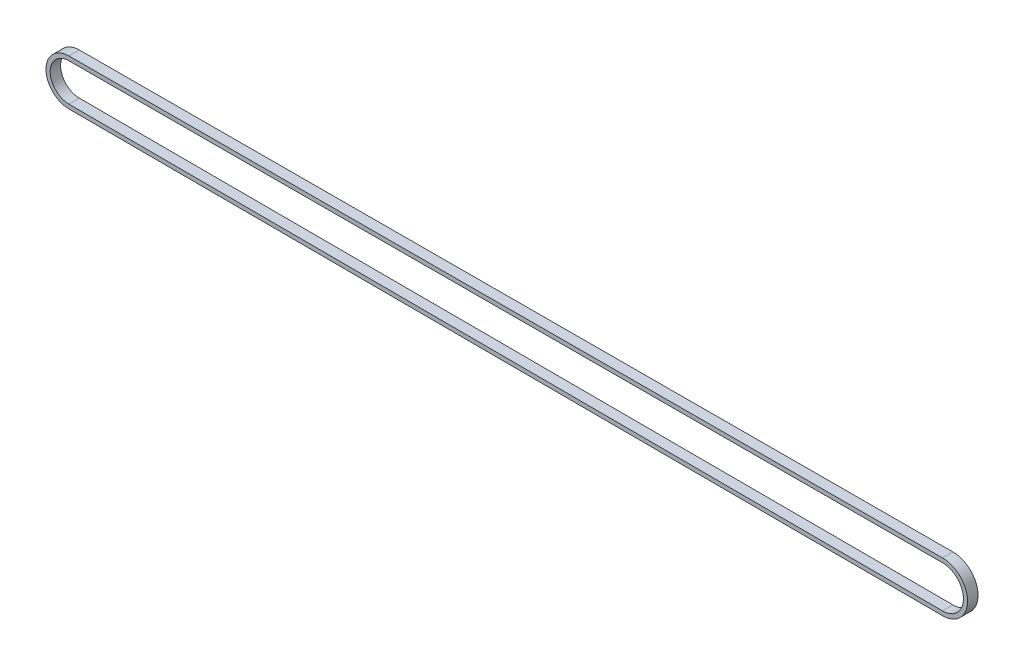
ISO-10303-21;
HEADER;
FILE_DESCRIPTION(('STEP AP214'),'2;1');
FILE_NAME('part.step','',(''),(''),'','','');
FILE_SCHEMA(('AUTOMOTIVE_DESIGN { 1 0 10303 214 1 1 1 1 }'));
ENDSEC;
DATA;
#1=APPLICATION_CONTEXT('core data for automotive mechanical design processes');
#2=APPLICATION_PROTOCOL_DEFINITION('international standard','automotive_design',2000,#1);
#3=PRODUCT_CONTEXT('',#1,'mechanical');
#4=PRODUCT('Part','Part','',(#3));
#5=PRODUCT_RELATED_PRODUCT_CATEGORY('part','',(#4));
#6=PRODUCT_DEFINITION_FORMATION('','',#4);
#7=PRODUCT_DEFINITION_CONTEXT('part definition',#1,'design');
#8=PRODUCT_DEFINITION('design','',#6,#7);
#9=PRODUCT_DEFINITION_SHAPE('','',#8);
#10=(LENGTH_UNIT() NAMED_UNIT(*) SI_UNIT(.MILLI.,.METRE.));
#11=(NAMED_UNIT(*) PLANE_ANGLE_UNIT() SI_UNIT($,.RADIAN.));
#12=(NAMED_UNIT(*) SI_UNIT($,.STERADIAN.) SOLID_ANGLE_UNIT());
#13=UNCERTAINTY_MEASURE_WITH_UNIT(LENGTH_MEASURE(1.E-05),#10,'distance_accuracy_value','');
#14=(GEOMETRIC_REPRESENTATION_CONTEXT(3) GLOBAL_UNCERTAINTY_ASSIGNED_CONTEXT((#13)) GLOBAL_UNIT_ASSIGNED_CONTEXT((#10,
#11,#12)) REPRESENTATION_CONTEXT('',''));
#15=CARTESIAN_POINT('',(0.,0.,0.));
#16=DIRECTION('',(0.,0.,1.));
#17=DIRECTION('',(1.,0.,0.));
#18=AXIS2_PLACEMENT_3D('',#15,#16,#17);
#19=CARTESIAN_POINT('',(0.,0.,-5.));
#20=DIRECTION('',(0.,0.,1.));
#21=DIRECTION('',(1.,0.,0.));
#22=AXIS2_PLACEMENT_3D('',#19,#20,#21);
#23=CYLINDRICAL_SURFACE('',#22,12.);
#24=CARTESIAN_POINT('',(0.,0.,0.));
#25=DIRECTION('',(0.,0.,-1.));
#26=DIRECTION('',(-1.,0.,0.));
#27=AXIS2_PLACEMENT_3D('',#24,#25,#26);
#28=CIRCLE('',#27,12.);
#29=CARTESIAN_POINT('',(-0.0286396181383211,-11.999965823796,0.));
#30=VERTEX_POINT('',#29);
#31=CARTESIAN_POINT('',(-0.0286396181384263,11.999965823796,0.));
#32=VERTEX_POINT('',#31);
#33=EDGE_CURVE('E159',#30,#32,#28,.F.);
#34=ORIENTED_EDGE('',*,*,#33,.F.);
#35=DIRECTION('',(0.,0.,1.));
#36=VECTOR('',#35,1.);
#37=CARTESIAN_POINT('',(-0.0286396181383211,-11.999965823796,-5.));
#38=LINE('',#37,#36);
#39=CARTESIAN_POINT('',(-0.0286396181383211,-11.999965823796,-5.));
#40=VERTEX_POINT('',#39);
#41=EDGE_CURVE('E12',#40,#30,#38,.T.);
#42=ORIENTED_EDGE('',*,*,#41,.F.);
#43=CARTESIAN_POINT('',(0.,0.,-5.));
#44=DIRECTION('',(0.,0.,-1.));
#45=DIRECTION('',(-1.,0.,0.));
#46=AXIS2_PLACEMENT_3D('',#43,#44,#45);
#47=CIRCLE('',#46,12.);
#48=CARTESIAN_POINT('',(-0.0286396181384263,11.999965823796,-5.));
#49=VERTEX_POINT('',#48);
#50=EDGE_CURVE('E163',#40,#49,#47,.F.);
#51=ORIENTED_EDGE('',*,*,#50,.T.);
#52=DIRECTION('',(0.,0.,1.));
#53=VECTOR('',#52,1.);
#54=CARTESIAN_POINT('',(-0.0286396181384263,11.999965823796,-5.));
#55=LINE('',#54,#53);
#56=EDGE_CURVE('E64',#49,#32,#55,.T.);
#57=ORIENTED_EDGE('',*,*,#56,.T.);
#58=EDGE_LOOP('',(#34,#42,#51,#57));
#59=FACE_BOUND('',#58,.T.);
#60=ADVANCED_FACE('F61',(#59),#23,.T.);
#61=CARTESIAN_POINT('',(-0.0286396181383211,-11.999965823796,-5.));
#62=DIRECTION('',(-0.00238663484486009,-0.999997151983003,0.));
#63=DIRECTION('',(0.999997151983003,-0.00238663484486009,0.));
#64=AXIS2_PLACEMENT_3D('',#61,#62,#63);
#65=PLANE('',#64);
#66=DIRECTION('',(0.999997151983003,-0.00238663484486009,0.));
#67=VECTOR('',#66,1.);
#68=CARTESIAN_POINT('',(-0.0286396181383211,-11.999965823796,0.));
#69=LINE('',#68,#67);
#70=CARTESIAN_POINT('',(-419.026252983293,-10.9999686718167,0.));
#71=VERTEX_POINT('',#70);
#72=EDGE_CURVE('E167',#71,#30,#69,.T.);
#73=ORIENTED_EDGE('',*,*,#72,.F.);
#74=DIRECTION('',(0.,0.,1.));
#75=VECTOR('',#74,1.);
#76=CARTESIAN_POINT('',(-419.026252983293,-10.9999686718167,-5.));
#77=LINE('',#76,#75);
#78=CARTESIAN_POINT('',(-419.026252983293,-10.9999686718167,-5.));
#79=VERTEX_POINT('',#78);
#80=EDGE_CURVE('E69',#79,#71,#77,.T.);
#81=ORIENTED_EDGE('',*,*,#80,.F.);
#82=DIRECTION('',(0.999997151983003,-0.00238663484486009,0.));
#83=VECTOR('',#82,1.);
#84=CARTESIAN_POINT('',(-0.0286396181383211,-11.999965823796,-5.));
#85=LINE('',#84,#83);
#86=EDGE_CURVE('E173',#79,#40,#85,.T.);
#87=ORIENTED_EDGE('',*,*,#86,.T.);
#88=ORIENTED_EDGE('',*,*,#41,.T.);
#89=EDGE_LOOP('',(#73,#81,#87,#88));
#90=FACE_BOUND('',#89,.T.);
#91=ADVANCED_FACE('F199',(#90),#65,.T.);
#92=CARTESIAN_POINT('',(-418.999999999999,-3.62210261783957E-12,-5.));
#93=DIRECTION('',(0.,0.,1.));
#94=DIRECTION('',(1.,0.,0.));
#95=AXIS2_PLACEMENT_3D('',#92,#93,#94);
#96=CYLINDRICAL_SURFACE('',#95,11.);
#97=CARTESIAN_POINT('',(-418.999999999999,-3.62210261783957E-12,0.));
#98=DIRECTION('',(0.,0.,-1.));
#99=DIRECTION('',(-1.,0.,0.));
#100=AXIS2_PLACEMENT_3D('',#97,#98,#99);
#101=CIRCLE('',#100,11.);
#102=CARTESIAN_POINT('',(-419.026252983293,10.9999686718094,0.));
#103=VERTEX_POINT('',#102);
#104=EDGE_CURVE('E181',#103,#71,#101,.F.);
#105=ORIENTED_EDGE('',*,*,#104,.F.);
#106=DIRECTION('',(0.,0.,1.));
#107=VECTOR('',#106,1.);
#108=CARTESIAN_POINT('',(-419.026252983293,10.9999686718094,-5.));
#109=LINE('',#108,#107);
#110=CARTESIAN_POINT('',(-419.026252983293,10.9999686718094,-5.));
#111=VERTEX_POINT('',#110);
#112=EDGE_CURVE('E186',#111,#103,#109,.T.);
#113=ORIENTED_EDGE('',*,*,#112,.F.);
#114=CARTESIAN_POINT('',(-418.999999999999,-3.62210261783957E-12,-5.));
#115=DIRECTION('',(0.,0.,-1.));
#116=DIRECTION('',(-1.,0.,0.));
#117=AXIS2_PLACEMENT_3D('',#114,#115,#116);
#118=CIRCLE('',#117,11.);
#119=EDGE_CURVE('E170',#111,#79,#118,.F.);
#120=ORIENTED_EDGE('',*,*,#119,.T.);
#121=ORIENTED_EDGE('',*,*,#80,.T.);
#122=EDGE_LOOP('',(#105,#113,#120,#121));
#123=FACE_BOUND('',#122,.T.);
#124=ADVANCED_FACE('F203',(#123),#96,.T.);
#125=CARTESIAN_POINT('',(-0.0286396181385286,11.999965823796,-5.));
#126=DIRECTION('',(-0.00238663484487738,0.999997151983003,0.));
#127=DIRECTION('',(-0.999997151983003,-0.00238663484487738,0.));
#128=AXIS2_PLACEMENT_3D('',#125,#126,#127);
#129=PLANE('',#128);
#130=DIRECTION('',(-0.999997151983003,-0.00238663484487738,0.));
#131=VECTOR('',#130,1.);
#132=CARTESIAN_POINT('',(-0.0286396181385286,11.999965823796,0.));
#133=LINE('',#132,#131);
#134=EDGE_CURVE('E178',#32,#103,#133,.T.);
#135=ORIENTED_EDGE('',*,*,#134,.F.);
#136=ORIENTED_EDGE('',*,*,#56,.F.);
#137=DIRECTION('',(-0.999997151983003,-0.00238663484487738,0.));
#138=VECTOR('',#137,1.);
#139=CARTESIAN_POINT('',(-0.0286396181385286,11.999965823796,-5.));
#140=LINE('',#139,#138);
#141=EDGE_CURVE('E166',#49,#111,#140,.T.);
#142=ORIENTED_EDGE('',*,*,#141,.T.);
#143=ORIENTED_EDGE('',*,*,#112,.T.);
#144=EDGE_LOOP('',(#135,#136,#142,#143));
#145=FACE_BOUND('',#144,.T.);
#146=ADVANCED_FACE('F194',(#145),#129,.T.);
#147=CARTESIAN_POINT('',(0.,0.,-5.));
#148=DIRECTION('',(0.,0.,-1.));
#149=DIRECTION('',(-1.,0.,0.));
#150=AXIS2_PLACEMENT_3D('',#147,#148,#149);
#151=PLANE('',#150);
#152=CARTESIAN_POINT('',(0.,0.,-5.));
#153=DIRECTION('',(0.,0.,1.));
#154=DIRECTION('',(-1.,0.,0.));
#155=AXIS2_PLACEMENT_3D('',#152,#153,#154);
#156=CIRCLE('',#155,10.);
#157=CARTESIAN_POINT('',(-0.0238663484486009,-9.99997151983003,-5.));
#158=VERTEX_POINT('',#157);
#159=CARTESIAN_POINT('',(-0.0238663484487738,9.99997151983003,-5.));
#160=VERTEX_POINT('',#159);
#161=EDGE_CURVE('E128',#158,#160,#156,.T.);
#162=ORIENTED_EDGE('',*,*,#161,.T.);
#163=DIRECTION('',(-0.999997151983003,-0.00238663484487738,0.));
#164=VECTOR('',#163,1.);
#165=CARTESIAN_POINT('',(-419.021479713603,8.99997436784341,-5.));
#166=LINE('',#165,#164);
#167=CARTESIAN_POINT('',(-419.021479713603,8.99997436784341,-5.));
#168=VERTEX_POINT('',#167);
#169=EDGE_CURVE('E137',#160,#168,#166,.T.);
#170=ORIENTED_EDGE('',*,*,#169,.T.);
#171=CARTESIAN_POINT('',(-418.999999999999,-3.62210261783957E-12,-5.));
#172=DIRECTION('',(0.,0.,1.));
#173=DIRECTION('',(-1.,0.,0.));
#174=AXIS2_PLACEMENT_3D('',#171,#172,#173);
#175=CIRCLE('',#174,9.);
#176=CARTESIAN_POINT('',(-419.021479713603,-8.99997436785065,-5.));
#177=VERTEX_POINT('',#176);
#178=EDGE_CURVE('E77',#168,#177,#175,.T.);
#179=ORIENTED_EDGE('',*,*,#178,.T.);
#180=DIRECTION('',(0.999997151983003,-0.00238663484486009,0.));
#181=VECTOR('',#180,1.);
#182=CARTESIAN_POINT('',(-0.0238663484486009,-9.99997151983003,-5.));
#183=LINE('',#182,#181);
#184=EDGE_CURVE('E134',#177,#158,#183,.T.);
#185=ORIENTED_EDGE('',*,*,#184,.T.);
#186=EDGE_LOOP('',(#162,#170,#179,#185));
#187=FACE_BOUND('',#186,.T.);
#188=ORIENTED_EDGE('',*,*,#50,.F.);
#189=ORIENTED_EDGE('',*,*,#86,.F.);
#190=ORIENTED_EDGE('',*,*,#119,.F.);
#191=ORIENTED_EDGE('',*,*,#141,.F.);
#192=EDGE_LOOP('',(#188,#189,#190,#191));
#193=FACE_BOUND('',#192,.T.);
#194=ADVANCED_FACE('F141',(#187,#193),#151,.T.);
#195=CARTESIAN_POINT('',(0.,0.,0.));
#196=DIRECTION('',(0.,0.,-1.));
#197=DIRECTION('',(-1.,0.,0.));
#198=AXIS2_PLACEMENT_3D('',#195,#196,#197);
#199=PLANE('',#198);
#200=DIRECTION('',(-0.999997151983003,-0.00238663484487738,0.));
#201=VECTOR('',#200,1.);
#202=CARTESIAN_POINT('',(-419.021479713603,8.99997436784341,0.));
#203=LINE('',#202,#201);
#204=CARTESIAN_POINT('',(-0.0238663484487738,9.99997151983003,0.));
#205=VERTEX_POINT('',#204);
#206=CARTESIAN_POINT('',(-419.021479713603,8.99997436784341,0.));
#207=VERTEX_POINT('',#206);
#208=EDGE_CURVE('E153',#205,#207,#203,.T.);
#209=ORIENTED_EDGE('',*,*,#208,.F.);
#210=CARTESIAN_POINT('',(0.,0.,0.));
#211=DIRECTION('',(0.,0.,1.));
#212=DIRECTION('',(-1.,0.,0.));
#213=AXIS2_PLACEMENT_3D('',#210,#211,#212);
#214=CIRCLE('',#213,10.);
#215=CARTESIAN_POINT('',(-0.0238663484486009,-9.99997151983003,0.));
#216=VERTEX_POINT('',#215);
#217=EDGE_CURVE('E85',#216,#205,#214,.T.);
#218=ORIENTED_EDGE('',*,*,#217,.F.);
#219=DIRECTION('',(0.999997151983003,-0.00238663484486009,0.));
#220=VECTOR('',#219,1.);
#221=CARTESIAN_POINT('',(-0.0238663484486009,-9.99997151983003,0.));
#222=LINE('',#221,#220);
#223=CARTESIAN_POINT('',(-419.021479713603,-8.99997436785065,0.));
#224=VERTEX_POINT('',#223);
#225=EDGE_CURVE('E144',#224,#216,#222,.T.);
#226=ORIENTED_EDGE('',*,*,#225,.F.);
#227=CARTESIAN_POINT('',(-418.999999999999,-3.62210261783957E-12,0.));
#228=DIRECTION('',(0.,0.,1.));
#229=DIRECTION('',(-1.,0.,0.));
#230=AXIS2_PLACEMENT_3D('',#227,#228,#229);
#231=CIRCLE('',#230,9.);
#232=EDGE_CURVE('E147',#207,#224,#231,.T.);
#233=ORIENTED_EDGE('',*,*,#232,.F.);
#234=EDGE_LOOP('',(#209,#218,#226,#233));
#235=FACE_BOUND('',#234,.T.);
#236=ORIENTED_EDGE('',*,*,#33,.T.);
#237=ORIENTED_EDGE('',*,*,#134,.T.);
#238=ORIENTED_EDGE('',*,*,#104,.T.);
#239=ORIENTED_EDGE('',*,*,#72,.T.);
#240=EDGE_LOOP('',(#236,#237,#238,#239));
#241=FACE_BOUND('',#240,.T.);
#242=ADVANCED_FACE('F196',(#235,#241),#199,.F.);
#243=CARTESIAN_POINT('',(0.,0.,-5.));
#244=DIRECTION('',(0.,0.,1.));
#245=DIRECTION('',(1.,0.,0.));
#246=AXIS2_PLACEMENT_3D('',#243,#244,#245);
#247=CYLINDRICAL_SURFACE('',#246,10.);
#248=ORIENTED_EDGE('',*,*,#217,.T.);
#249=DIRECTION('',(0.,0.,1.));
#250=VECTOR('',#249,1.);
#251=CARTESIAN_POINT('',(-0.0238663484487738,9.99997151983003,-5.));
#252=LINE('',#251,#250);
#253=EDGE_CURVE('E124',#160,#205,#252,.T.);
#254=ORIENTED_EDGE('',*,*,#253,.F.);
#255=ORIENTED_EDGE('',*,*,#161,.F.);
#256=DIRECTION('',(0.,0.,1.));
#257=VECTOR('',#256,1.);
#258=CARTESIAN_POINT('',(-0.0238663484486009,-9.99997151983003,-5.));
#259=LINE('',#258,#257);
#260=EDGE_CURVE('E157',#158,#216,#259,.T.);
#261=ORIENTED_EDGE('',*,*,#260,.T.);
#262=EDGE_LOOP('',(#248,#254,#255,#261));
#263=FACE_BOUND('',#262,.T.);
#264=ADVANCED_FACE('F126',(#263),#247,.F.);
#265=CARTESIAN_POINT('',(-0.0238663484486009,-9.99997151983003,-5.));
#266=DIRECTION('',(-0.00238663484486009,-0.999997151983003,0.));
#267=DIRECTION('',(0.999997151983003,-0.00238663484486009,0.));
#268=AXIS2_PLACEMENT_3D('',#265,#266,#267);
#269=PLANE('',#268);
#270=ORIENTED_EDGE('',*,*,#225,.T.);
#271=ORIENTED_EDGE('',*,*,#260,.F.);
#272=ORIENTED_EDGE('',*,*,#184,.F.);
#273=DIRECTION('',(0.,0.,1.));
#274=VECTOR('',#273,1.);
#275=CARTESIAN_POINT('',(-419.021479713603,-8.99997436785065,-5.));
#276=LINE('',#275,#274);
#277=EDGE_CURVE('E160',#177,#224,#276,.T.);
#278=ORIENTED_EDGE('',*,*,#277,.T.);
#279=EDGE_LOOP('',(#270,#271,#272,#278));
#280=FACE_BOUND('',#279,.T.);
#281=ADVANCED_FACE('F259',(#280),#269,.F.);
#282=CARTESIAN_POINT('',(-418.999999999999,-3.62210261783957E-12,-5.));
#283=DIRECTION('',(0.,0.,1.));
#284=DIRECTION('',(1.,0.,0.));
#285=AXIS2_PLACEMENT_3D('',#282,#283,#284);
#286=CYLINDRICAL_SURFACE('',#285,9.);
#287=ORIENTED_EDGE('',*,*,#232,.T.);
#288=ORIENTED_EDGE('',*,*,#277,.F.);
#289=ORIENTED_EDGE('',*,*,#178,.F.);
#290=DIRECTION('',(0.,0.,1.));
#291=VECTOR('',#290,1.);
#292=CARTESIAN_POINT('',(-419.021479713603,8.99997436784341,-5.));
#293=LINE('',#292,#291);
#294=EDGE_CURVE('E133',#168,#207,#293,.T.);
#295=ORIENTED_EDGE('',*,*,#294,.T.);
#296=EDGE_LOOP('',(#287,#288,#289,#295));
#297=FACE_BOUND('',#296,.T.);
#298=ADVANCED_FACE('F269',(#297),#286,.F.);
#299=CARTESIAN_POINT('',(-419.021479713603,8.99997436784341,-5.));
#300=DIRECTION('',(-0.00238663484487738,0.999997151983003,0.));
#301=DIRECTION('',(-0.999997151983003,-0.00238663484487738,0.));
#302=AXIS2_PLACEMENT_3D('',#299,#300,#301);
#303=PLANE('',#302);
#304=ORIENTED_EDGE('',*,*,#208,.T.);
#305=ORIENTED_EDGE('',*,*,#294,.F.);
#306=ORIENTED_EDGE('',*,*,#169,.F.);
#307=ORIENTED_EDGE('',*,*,#253,.T.);
#308=EDGE_LOOP('',(#304,#305,#306,#307));
#309=FACE_BOUND('',#308,.T.);
#310=ADVANCED_FACE('F138',(#309),#303,.F.);
#311=CLOSED_SHELL('',(#60,#91,#124,#146,#194,#242,#264,#281,#298,#310));
#312=MANIFOLD_SOLID_BREP('B2',#311);
#313=ADVANCED_BREP_SHAPE_REPRESENTATION('',(#18,#312),#14);
#314=SHAPE_DEFINITION_REPRESENTATION(#9,#313);
ENDSEC;
END-ISO-10303-21;
